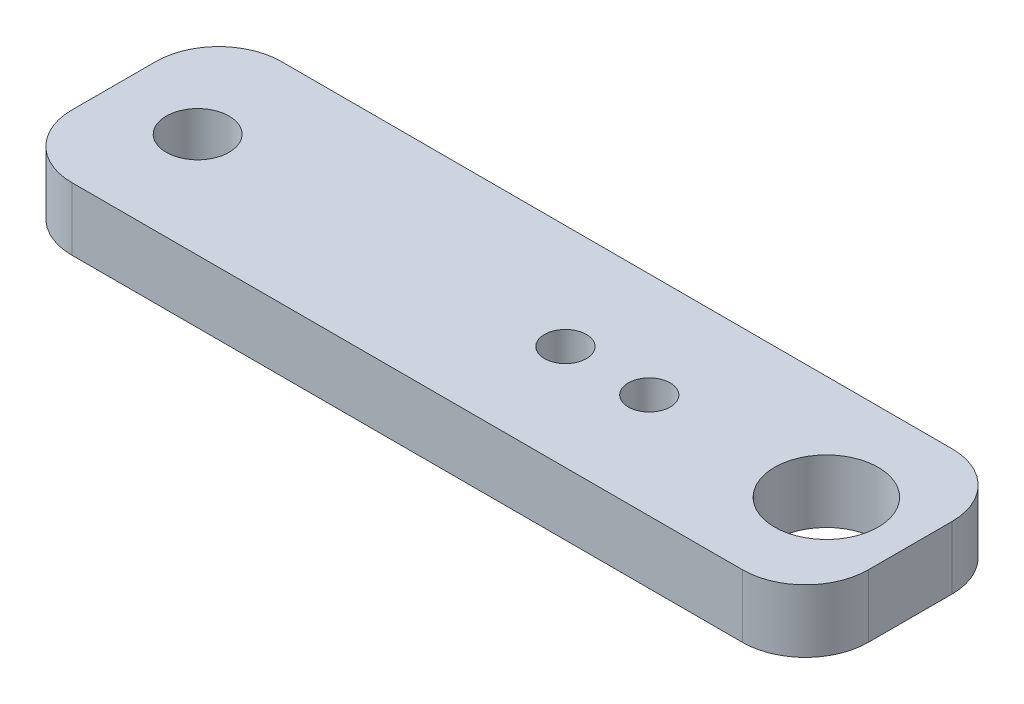
ISO-10303-21;
HEADER;
FILE_DESCRIPTION(('STEP AP214'),'2;1');
FILE_NAME('part.step','',(''),(''),'','','');
FILE_SCHEMA(('AUTOMOTIVE_DESIGN { 1 0 10303 214 1 1 1 1 }'));
ENDSEC;
DATA;
#1=APPLICATION_CONTEXT('core data for automotive mechanical design processes');
#2=APPLICATION_PROTOCOL_DEFINITION('international standard','automotive_design',2000,#1);
#3=PRODUCT_CONTEXT('',#1,'mechanical');
#4=PRODUCT('Part','Part','',(#3));
#5=PRODUCT_RELATED_PRODUCT_CATEGORY('part','',(#4));
#6=PRODUCT_DEFINITION_FORMATION('','',#4);
#7=PRODUCT_DEFINITION_CONTEXT('part definition',#1,'design');
#8=PRODUCT_DEFINITION('design','',#6,#7);
#9=PRODUCT_DEFINITION_SHAPE('','',#8);
#10=(LENGTH_UNIT() NAMED_UNIT(*) SI_UNIT(.MILLI.,.METRE.));
#11=(NAMED_UNIT(*) PLANE_ANGLE_UNIT() SI_UNIT($,.RADIAN.));
#12=(NAMED_UNIT(*) SI_UNIT($,.STERADIAN.) SOLID_ANGLE_UNIT());
#13=UNCERTAINTY_MEASURE_WITH_UNIT(LENGTH_MEASURE(1.E-05),#10,'distance_accuracy_value','');
#14=(GEOMETRIC_REPRESENTATION_CONTEXT(3) GLOBAL_UNCERTAINTY_ASSIGNED_CONTEXT((#13)) GLOBAL_UNIT_ASSIGNED_CONTEXT((#10,
#11,#12)) REPRESENTATION_CONTEXT('',''));
#15=CARTESIAN_POINT('',(0.,0.,0.));
#16=DIRECTION('',(0.,0.,1.));
#17=DIRECTION('',(1.,0.,0.));
#18=AXIS2_PLACEMENT_3D('',#15,#16,#17);
#19=CARTESIAN_POINT('',(19.,3.,-5.));
#20=DIRECTION('',(-1.,0.,0.));
#21=DIRECTION('',(0.,0.,1.));
#22=AXIS2_PLACEMENT_3D('',#19,#20,#21);
#23=PLANE('',#22);
#24=DIRECTION('',(0.,0.,-1.));
#25=VECTOR('',#24,1.);
#26=CARTESIAN_POINT('',(19.,3.,-5.));
#27=LINE('',#26,#25);
#28=CARTESIAN_POINT('',(19.,3.,2.));
#29=VERTEX_POINT('',#28);
#30=CARTESIAN_POINT('',(19.,3.,-2.));
#31=VERTEX_POINT('',#30);
#32=EDGE_CURVE('E128',#29,#31,#27,.T.);
#33=ORIENTED_EDGE('',*,*,#32,.F.);
#34=DIRECTION('',(0.,-1.,0.));
#35=VECTOR('',#34,1.);
#36=CARTESIAN_POINT('',(19.,3.,2.));
#37=LINE('',#36,#35);
#38=CARTESIAN_POINT('',(19.,0.,2.));
#39=VERTEX_POINT('',#38);
#40=EDGE_CURVE('E11',#29,#39,#37,.T.);
#41=ORIENTED_EDGE('',*,*,#40,.T.);
#42=DIRECTION('',(0.,0.,-1.));
#43=VECTOR('',#42,1.);
#44=CARTESIAN_POINT('',(19.,0.,-5.));
#45=LINE('',#44,#43);
#46=CARTESIAN_POINT('',(19.,0.,-2.));
#47=VERTEX_POINT('',#46);
#48=EDGE_CURVE('E130',#39,#47,#45,.T.);
#49=ORIENTED_EDGE('',*,*,#48,.T.);
#50=DIRECTION('',(0.,-1.,0.));
#51=VECTOR('',#50,1.);
#52=CARTESIAN_POINT('',(19.,3.,-2.));
#53=LINE('',#52,#51);
#54=EDGE_CURVE('E41',#47,#31,#53,.F.);
#55=ORIENTED_EDGE('',*,*,#54,.T.);
#56=EDGE_LOOP('',(#33,#41,#49,#55));
#57=FACE_BOUND('',#56,.T.);
#58=ADVANCED_FACE('F33',(#57),#23,.F.);
#59=CARTESIAN_POINT('',(-19.,3.,-5.));
#60=DIRECTION('',(0.,0.,1.));
#61=DIRECTION('',(1.,0.,0.));
#62=AXIS2_PLACEMENT_3D('',#59,#60,#61);
#63=PLANE('',#62);
#64=DIRECTION('',(-1.,0.,0.));
#65=VECTOR('',#64,1.);
#66=CARTESIAN_POINT('',(-19.,0.,-5.));
#67=LINE('',#66,#65);
#68=CARTESIAN_POINT('',(16.,0.,-5.));
#69=VERTEX_POINT('',#68);
#70=CARTESIAN_POINT('',(-16.,0.,-5.));
#71=VERTEX_POINT('',#70);
#72=EDGE_CURVE('E126',#69,#71,#67,.T.);
#73=ORIENTED_EDGE('',*,*,#72,.T.);
#74=DIRECTION('',(0.,-1.,0.));
#75=VECTOR('',#74,1.);
#76=CARTESIAN_POINT('',(-16.,3.,-5.));
#77=LINE('',#76,#75);
#78=CARTESIAN_POINT('',(-16.,3.,-5.));
#79=VERTEX_POINT('',#78);
#80=EDGE_CURVE('E105',#71,#79,#77,.F.);
#81=ORIENTED_EDGE('',*,*,#80,.T.);
#82=DIRECTION('',(-1.,0.,0.));
#83=VECTOR('',#82,1.);
#84=CARTESIAN_POINT('',(-19.,3.,-5.));
#85=LINE('',#84,#83);
#86=CARTESIAN_POINT('',(16.,3.,-5.));
#87=VERTEX_POINT('',#86);
#88=EDGE_CURVE('E166',#87,#79,#85,.T.);
#89=ORIENTED_EDGE('',*,*,#88,.F.);
#90=DIRECTION('',(0.,-1.,0.));
#91=VECTOR('',#90,1.);
#92=CARTESIAN_POINT('',(16.,3.,-5.));
#93=LINE('',#92,#91);
#94=EDGE_CURVE('E110',#87,#69,#93,.T.);
#95=ORIENTED_EDGE('',*,*,#94,.T.);
#96=EDGE_LOOP('',(#73,#81,#89,#95));
#97=FACE_BOUND('',#96,.T.);
#98=ADVANCED_FACE('F170',(#97),#63,.F.);
#99=CARTESIAN_POINT('',(-19.,3.,-5.));
#100=DIRECTION('',(1.,0.,0.));
#101=DIRECTION('',(0.,0.,-1.));
#102=AXIS2_PLACEMENT_3D('',#99,#100,#101);
#103=PLANE('',#102);
#104=DIRECTION('',(0.,0.,1.));
#105=VECTOR('',#104,1.);
#106=CARTESIAN_POINT('',(-19.,3.,-5.));
#107=LINE('',#106,#105);
#108=CARTESIAN_POINT('',(-19.,3.,-2.));
#109=VERTEX_POINT('',#108);
#110=CARTESIAN_POINT('',(-19.,3.,2.));
#111=VERTEX_POINT('',#110);
#112=EDGE_CURVE('E119',#109,#111,#107,.T.);
#113=ORIENTED_EDGE('',*,*,#112,.F.);
#114=DIRECTION('',(0.,-1.,0.));
#115=VECTOR('',#114,1.);
#116=CARTESIAN_POINT('',(-19.,3.,-2.));
#117=LINE('',#116,#115);
#118=CARTESIAN_POINT('',(-19.,0.,-2.));
#119=VERTEX_POINT('',#118);
#120=EDGE_CURVE('E104',#109,#119,#117,.T.);
#121=ORIENTED_EDGE('',*,*,#120,.T.);
#122=DIRECTION('',(0.,0.,1.));
#123=VECTOR('',#122,1.);
#124=CARTESIAN_POINT('',(-19.,0.,-5.));
#125=LINE('',#124,#123);
#126=CARTESIAN_POINT('',(-19.,0.,2.));
#127=VERTEX_POINT('',#126);
#128=EDGE_CURVE('E117',#119,#127,#125,.T.);
#129=ORIENTED_EDGE('',*,*,#128,.T.);
#130=DIRECTION('',(0.,-1.,0.));
#131=VECTOR('',#130,1.);
#132=CARTESIAN_POINT('',(-19.,3.,2.));
#133=LINE('',#132,#131);
#134=EDGE_CURVE('E121',#127,#111,#133,.F.);
#135=ORIENTED_EDGE('',*,*,#134,.T.);
#136=EDGE_LOOP('',(#113,#121,#129,#135));
#137=FACE_BOUND('',#136,.T.);
#138=ADVANCED_FACE('F116',(#137),#103,.F.);
#139=CARTESIAN_POINT('',(-19.,3.,5.));
#140=DIRECTION('',(0.,0.,-1.));
#141=DIRECTION('',(-1.,0.,0.));
#142=AXIS2_PLACEMENT_3D('',#139,#140,#141);
#143=PLANE('',#142);
#144=DIRECTION('',(1.,0.,0.));
#145=VECTOR('',#144,1.);
#146=CARTESIAN_POINT('',(-19.,3.,5.));
#147=LINE('',#146,#145);
#148=CARTESIAN_POINT('',(-16.,3.,5.));
#149=VERTEX_POINT('',#148);
#150=CARTESIAN_POINT('',(16.,3.,5.));
#151=VERTEX_POINT('',#150);
#152=EDGE_CURVE('E134',#149,#151,#147,.T.);
#153=ORIENTED_EDGE('',*,*,#152,.F.);
#154=DIRECTION('',(0.,-1.,0.));
#155=VECTOR('',#154,1.);
#156=CARTESIAN_POINT('',(-16.,3.,5.));
#157=LINE('',#156,#155);
#158=CARTESIAN_POINT('',(-16.,0.,5.));
#159=VERTEX_POINT('',#158);
#160=EDGE_CURVE('E151',#149,#159,#157,.T.);
#161=ORIENTED_EDGE('',*,*,#160,.T.);
#162=DIRECTION('',(1.,0.,0.));
#163=VECTOR('',#162,1.);
#164=CARTESIAN_POINT('',(-19.,0.,5.));
#165=LINE('',#164,#163);
#166=CARTESIAN_POINT('',(16.,0.,5.));
#167=VERTEX_POINT('',#166);
#168=EDGE_CURVE('E125',#159,#167,#165,.T.);
#169=ORIENTED_EDGE('',*,*,#168,.T.);
#170=DIRECTION('',(0.,-1.,0.));
#171=VECTOR('',#170,1.);
#172=CARTESIAN_POINT('',(16.,3.,5.));
#173=LINE('',#172,#171);
#174=EDGE_CURVE('E48',#167,#151,#173,.F.);
#175=ORIENTED_EDGE('',*,*,#174,.T.);
#176=EDGE_LOOP('',(#153,#161,#169,#175));
#177=FACE_BOUND('',#176,.T.);
#178=ADVANCED_FACE('F204',(#177),#143,.F.);
#179=CARTESIAN_POINT('',(0.,3.,0.));
#180=DIRECTION('',(0.,1.,0.));
#181=DIRECTION('',(0.,0.,1.));
#182=AXIS2_PLACEMENT_3D('',#179,#180,#181);
#183=PLANE('',#182);
#184=CARTESIAN_POINT('',(-15.,3.,0.));
#185=DIRECTION('',(0.,1.,0.));
#186=DIRECTION('',(0.,0.,1.));
#187=AXIS2_PLACEMENT_3D('',#184,#185,#186);
#188=CIRCLE('',#187,1.5);
#189=CARTESIAN_POINT('',(-15.,3.,1.5));
#190=VERTEX_POINT('',#189);
#191=EDGE_CURVE('E196',#190,#190,#188,.T.);
#192=ORIENTED_EDGE('',*,*,#191,.F.);
#193=EDGE_LOOP('',(#192));
#194=FACE_BOUND('',#193,.T.);
#195=CARTESIAN_POINT('',(15.,3.,0.));
#196=DIRECTION('',(0.,1.,0.));
#197=DIRECTION('',(0.,0.,1.));
#198=AXIS2_PLACEMENT_3D('',#195,#196,#197);
#199=CIRCLE('',#198,2.47286435846186);
#200=CARTESIAN_POINT('',(15.,3.,2.47286435846186));
#201=VERTEX_POINT('',#200);
#202=EDGE_CURVE('E173',#201,#201,#199,.T.);
#203=ORIENTED_EDGE('',*,*,#202,.F.);
#204=EDGE_LOOP('',(#203));
#205=FACE_BOUND('',#204,.T.);
#206=CARTESIAN_POINT('',(6.55000000000001,3.,0.));
#207=DIRECTION('',(0.,1.,0.));
#208=DIRECTION('',(0.,0.,-1.));
#209=AXIS2_PLACEMENT_3D('',#206,#207,#208);
#210=CIRCLE('',#209,1.);
#211=CARTESIAN_POINT('',(6.55000000000001,3.,-1.));
#212=VERTEX_POINT('',#211);
#213=EDGE_CURVE('E186',#212,#212,#210,.T.);
#214=ORIENTED_EDGE('',*,*,#213,.F.);
#215=EDGE_LOOP('',(#214));
#216=FACE_BOUND('',#215,.T.);
#217=CARTESIAN_POINT('',(2.55000000000001,3.,0.));
#218=DIRECTION('',(0.,1.,0.));
#219=DIRECTION('',(0.,0.,-1.));
#220=AXIS2_PLACEMENT_3D('',#217,#218,#219);
#221=CIRCLE('',#220,1.);
#222=CARTESIAN_POINT('',(2.55000000000001,3.,-1.));
#223=VERTEX_POINT('',#222);
#224=EDGE_CURVE('E179',#223,#223,#221,.T.);
#225=ORIENTED_EDGE('',*,*,#224,.F.);
#226=EDGE_LOOP('',(#225));
#227=FACE_BOUND('',#226,.T.);
#228=ORIENTED_EDGE('',*,*,#88,.T.);
#229=CARTESIAN_POINT('',(-16.,3.,-2.));
#230=DIRECTION('',(0.,1.,0.));
#231=DIRECTION('',(0.,0.,1.));
#232=AXIS2_PLACEMENT_3D('',#229,#230,#231);
#233=CIRCLE('',#232,3.);
#234=EDGE_CURVE('E148',#79,#109,#233,.T.);
#235=ORIENTED_EDGE('',*,*,#234,.T.);
#236=ORIENTED_EDGE('',*,*,#112,.T.);
#237=CARTESIAN_POINT('',(-16.,3.,2.));
#238=DIRECTION('',(0.,1.,0.));
#239=DIRECTION('',(0.,0.,1.));
#240=AXIS2_PLACEMENT_3D('',#237,#238,#239);
#241=CIRCLE('',#240,3.);
#242=EDGE_CURVE('E55',#111,#149,#241,.T.);
#243=ORIENTED_EDGE('',*,*,#242,.T.);
#244=ORIENTED_EDGE('',*,*,#152,.T.);
#245=CARTESIAN_POINT('',(16.,3.,2.));
#246=DIRECTION('',(0.,1.,0.));
#247=DIRECTION('',(0.,0.,1.));
#248=AXIS2_PLACEMENT_3D('',#245,#246,#247);
#249=CIRCLE('',#248,3.);
#250=EDGE_CURVE('E145',#151,#29,#249,.T.);
#251=ORIENTED_EDGE('',*,*,#250,.T.);
#252=ORIENTED_EDGE('',*,*,#32,.T.);
#253=CARTESIAN_POINT('',(16.,3.,-2.));
#254=DIRECTION('',(0.,1.,0.));
#255=DIRECTION('',(0.,0.,1.));
#256=AXIS2_PLACEMENT_3D('',#253,#254,#255);
#257=CIRCLE('',#256,3.);
#258=EDGE_CURVE('E143',#31,#87,#257,.T.);
#259=ORIENTED_EDGE('',*,*,#258,.T.);
#260=EDGE_LOOP('',(#228,#235,#236,#243,#244,#251,#252,#259));
#261=FACE_BOUND('',#260,.T.);
#262=ADVANCED_FACE('F163',(#194,#205,#216,#227,#261),#183,.T.);
#263=CARTESIAN_POINT('',(0.,0.,0.));
#264=DIRECTION('',(0.,1.,0.));
#265=DIRECTION('',(0.,0.,1.));
#266=AXIS2_PLACEMENT_3D('',#263,#264,#265);
#267=PLANE('',#266);
#268=CARTESIAN_POINT('',(-15.,0.,0.));
#269=DIRECTION('',(0.,1.,0.));
#270=DIRECTION('',(0.,0.,1.));
#271=AXIS2_PLACEMENT_3D('',#268,#269,#270);
#272=CIRCLE('',#271,1.5);
#273=CARTESIAN_POINT('',(-15.,0.,1.5));
#274=VERTEX_POINT('',#273);
#275=EDGE_CURVE('E183',#274,#274,#272,.T.);
#276=ORIENTED_EDGE('',*,*,#275,.T.);
#277=EDGE_LOOP('',(#276));
#278=FACE_BOUND('',#277,.T.);
#279=CARTESIAN_POINT('',(15.,0.,0.));
#280=DIRECTION('',(0.,1.,0.));
#281=DIRECTION('',(0.,0.,1.));
#282=AXIS2_PLACEMENT_3D('',#279,#280,#281);
#283=CIRCLE('',#282,2.47286435846186);
#284=CARTESIAN_POINT('',(15.,0.,2.47286435846186));
#285=VERTEX_POINT('',#284);
#286=EDGE_CURVE('E171',#285,#285,#283,.T.);
#287=ORIENTED_EDGE('',*,*,#286,.T.);
#288=EDGE_LOOP('',(#287));
#289=FACE_BOUND('',#288,.T.);
#290=CARTESIAN_POINT('',(6.55000000000001,0.,0.));
#291=DIRECTION('',(0.,1.,0.));
#292=DIRECTION('',(0.,0.,-1.));
#293=AXIS2_PLACEMENT_3D('',#290,#291,#292);
#294=CIRCLE('',#293,1.);
#295=CARTESIAN_POINT('',(6.55000000000001,0.,-1.));
#296=VERTEX_POINT('',#295);
#297=EDGE_CURVE('E189',#296,#296,#294,.T.);
#298=ORIENTED_EDGE('',*,*,#297,.T.);
#299=EDGE_LOOP('',(#298));
#300=FACE_BOUND('',#299,.T.);
#301=CARTESIAN_POINT('',(2.55000000000001,0.,0.));
#302=DIRECTION('',(0.,1.,0.));
#303=DIRECTION('',(0.,0.,-1.));
#304=AXIS2_PLACEMENT_3D('',#301,#302,#303);
#305=CIRCLE('',#304,1.);
#306=CARTESIAN_POINT('',(2.55000000000001,0.,-1.));
#307=VERTEX_POINT('',#306);
#308=EDGE_CURVE('E182',#307,#307,#305,.T.);
#309=ORIENTED_EDGE('',*,*,#308,.T.);
#310=EDGE_LOOP('',(#309));
#311=FACE_BOUND('',#310,.T.);
#312=ORIENTED_EDGE('',*,*,#128,.F.);
#313=CARTESIAN_POINT('',(-16.,0.,-2.));
#314=DIRECTION('',(0.,1.,0.));
#315=DIRECTION('',(0.,0.,1.));
#316=AXIS2_PLACEMENT_3D('',#313,#314,#315);
#317=CIRCLE('',#316,3.);
#318=EDGE_CURVE('E100',#119,#71,#317,.F.);
#319=ORIENTED_EDGE('',*,*,#318,.T.);
#320=ORIENTED_EDGE('',*,*,#72,.F.);
#321=CARTESIAN_POINT('',(16.,0.,-2.));
#322=DIRECTION('',(0.,1.,0.));
#323=DIRECTION('',(0.,0.,1.));
#324=AXIS2_PLACEMENT_3D('',#321,#322,#323);
#325=CIRCLE('',#324,3.);
#326=EDGE_CURVE('E120',#69,#47,#325,.F.);
#327=ORIENTED_EDGE('',*,*,#326,.T.);
#328=ORIENTED_EDGE('',*,*,#48,.F.);
#329=CARTESIAN_POINT('',(16.,0.,2.));
#330=DIRECTION('',(0.,1.,0.));
#331=DIRECTION('',(0.,0.,1.));
#332=AXIS2_PLACEMENT_3D('',#329,#330,#331);
#333=CIRCLE('',#332,3.);
#334=EDGE_CURVE('E137',#39,#167,#333,.F.);
#335=ORIENTED_EDGE('',*,*,#334,.T.);
#336=ORIENTED_EDGE('',*,*,#168,.F.);
#337=CARTESIAN_POINT('',(-16.,0.,2.));
#338=DIRECTION('',(0.,1.,0.));
#339=DIRECTION('',(0.,0.,1.));
#340=AXIS2_PLACEMENT_3D('',#337,#338,#339);
#341=CIRCLE('',#340,3.);
#342=EDGE_CURVE('E111',#159,#127,#341,.F.);
#343=ORIENTED_EDGE('',*,*,#342,.T.);
#344=EDGE_LOOP('',(#312,#319,#320,#327,#328,#335,#336,#343));
#345=FACE_BOUND('',#344,.T.);
#346=ADVANCED_FACE('F123',(#278,#289,#300,#311,#345),#267,.F.);
#347=CARTESIAN_POINT('',(2.55000000000001,0.,0.));
#348=DIRECTION('',(0.,1.,0.));
#349=DIRECTION('',(0.,0.,1.));
#350=AXIS2_PLACEMENT_3D('',#347,#348,#349);
#351=CYLINDRICAL_SURFACE('',#350,1.);
#352=ORIENTED_EDGE('',*,*,#308,.F.);
#353=EDGE_LOOP('',(#352));
#354=FACE_BOUND('',#353,.T.);
#355=ORIENTED_EDGE('',*,*,#224,.T.);
#356=EDGE_LOOP('',(#355));
#357=FACE_BOUND('',#356,.T.);
#358=ADVANCED_FACE('F212',(#354,#357),#351,.F.);
#359=CARTESIAN_POINT('',(6.55000000000001,0.,0.));
#360=DIRECTION('',(0.,1.,0.));
#361=DIRECTION('',(0.,0.,1.));
#362=AXIS2_PLACEMENT_3D('',#359,#360,#361);
#363=CYLINDRICAL_SURFACE('',#362,1.);
#364=ORIENTED_EDGE('',*,*,#297,.F.);
#365=EDGE_LOOP('',(#364));
#366=FACE_BOUND('',#365,.T.);
#367=ORIENTED_EDGE('',*,*,#213,.T.);
#368=EDGE_LOOP('',(#367));
#369=FACE_BOUND('',#368,.T.);
#370=ADVANCED_FACE('F214',(#366,#369),#363,.F.);
#371=CARTESIAN_POINT('',(15.,0.,0.));
#372=DIRECTION('',(0.,1.,0.));
#373=DIRECTION('',(0.,0.,1.));
#374=AXIS2_PLACEMENT_3D('',#371,#372,#373);
#375=CYLINDRICAL_SURFACE('',#374,2.47286435846186);
#376=ORIENTED_EDGE('',*,*,#286,.F.);
#377=EDGE_LOOP('',(#376));
#378=FACE_BOUND('',#377,.T.);
#379=ORIENTED_EDGE('',*,*,#202,.T.);
#380=EDGE_LOOP('',(#379));
#381=FACE_BOUND('',#380,.T.);
#382=ADVANCED_FACE('F221',(#378,#381),#375,.F.);
#383=CARTESIAN_POINT('',(-16.,3.,-2.));
#384=DIRECTION('',(0.,-1.,0.));
#385=DIRECTION('',(0.,0.,-1.));
#386=AXIS2_PLACEMENT_3D('',#383,#384,#385);
#387=CYLINDRICAL_SURFACE('',#386,3.);
#388=ORIENTED_EDGE('',*,*,#234,.F.);
#389=ORIENTED_EDGE('',*,*,#80,.F.);
#390=ORIENTED_EDGE('',*,*,#318,.F.);
#391=ORIENTED_EDGE('',*,*,#120,.F.);
#392=EDGE_LOOP('',(#388,#389,#390,#391));
#393=FACE_BOUND('',#392,.T.);
#394=ADVANCED_FACE('F103',(#393),#387,.T.);
#395=CARTESIAN_POINT('',(-16.,3.,2.));
#396=DIRECTION('',(0.,-1.,0.));
#397=DIRECTION('',(0.,0.,-1.));
#398=AXIS2_PLACEMENT_3D('',#395,#396,#397);
#399=CYLINDRICAL_SURFACE('',#398,3.);
#400=ORIENTED_EDGE('',*,*,#242,.F.);
#401=ORIENTED_EDGE('',*,*,#134,.F.);
#402=ORIENTED_EDGE('',*,*,#342,.F.);
#403=ORIENTED_EDGE('',*,*,#160,.F.);
#404=EDGE_LOOP('',(#400,#401,#402,#403));
#405=FACE_BOUND('',#404,.T.);
#406=ADVANCED_FACE('F237',(#405),#399,.T.);
#407=CARTESIAN_POINT('',(16.,3.,2.));
#408=DIRECTION('',(0.,-1.,0.));
#409=DIRECTION('',(0.,0.,-1.));
#410=AXIS2_PLACEMENT_3D('',#407,#408,#409);
#411=CYLINDRICAL_SURFACE('',#410,3.);
#412=ORIENTED_EDGE('',*,*,#250,.F.);
#413=ORIENTED_EDGE('',*,*,#174,.F.);
#414=ORIENTED_EDGE('',*,*,#334,.F.);
#415=ORIENTED_EDGE('',*,*,#40,.F.);
#416=EDGE_LOOP('',(#412,#413,#414,#415));
#417=FACE_BOUND('',#416,.T.);
#418=ADVANCED_FACE('F239',(#417),#411,.T.);
#419=CARTESIAN_POINT('',(16.,3.,-2.));
#420=DIRECTION('',(0.,-1.,0.));
#421=DIRECTION('',(0.,0.,-1.));
#422=AXIS2_PLACEMENT_3D('',#419,#420,#421);
#423=CYLINDRICAL_SURFACE('',#422,3.);
#424=ORIENTED_EDGE('',*,*,#258,.F.);
#425=ORIENTED_EDGE('',*,*,#54,.F.);
#426=ORIENTED_EDGE('',*,*,#326,.F.);
#427=ORIENTED_EDGE('',*,*,#94,.F.);
#428=EDGE_LOOP('',(#424,#425,#426,#427));
#429=FACE_BOUND('',#428,.T.);
#430=ADVANCED_FACE('F35',(#429),#423,.T.);
#431=CARTESIAN_POINT('',(-15.,3.,0.));
#432=DIRECTION('',(0.,1.,0.));
#433=DIRECTION('',(0.,0.,1.));
#434=AXIS2_PLACEMENT_3D('',#431,#432,#433);
#435=CYLINDRICAL_SURFACE('',#434,1.5);
#436=ORIENTED_EDGE('',*,*,#275,.F.);
#437=EDGE_LOOP('',(#436));
#438=FACE_BOUND('',#437,.T.);
#439=ORIENTED_EDGE('',*,*,#191,.T.);
#440=EDGE_LOOP('',(#439));
#441=FACE_BOUND('',#440,.T.);
#442=ADVANCED_FACE('F200',(#438,#441),#435,.F.);
#443=CLOSED_SHELL('',(#58,#98,#138,#178,#262,#346,#358,#370,#382,#394,#406,#418,#430,#442));
#444=MANIFOLD_SOLID_BREP('B2',#443);
#445=ADVANCED_BREP_SHAPE_REPRESENTATION('',(#18,#444),#14);
#446=SHAPE_DEFINITION_REPRESENTATION(#9,#445);
ENDSEC;
END-ISO-10303-21;
